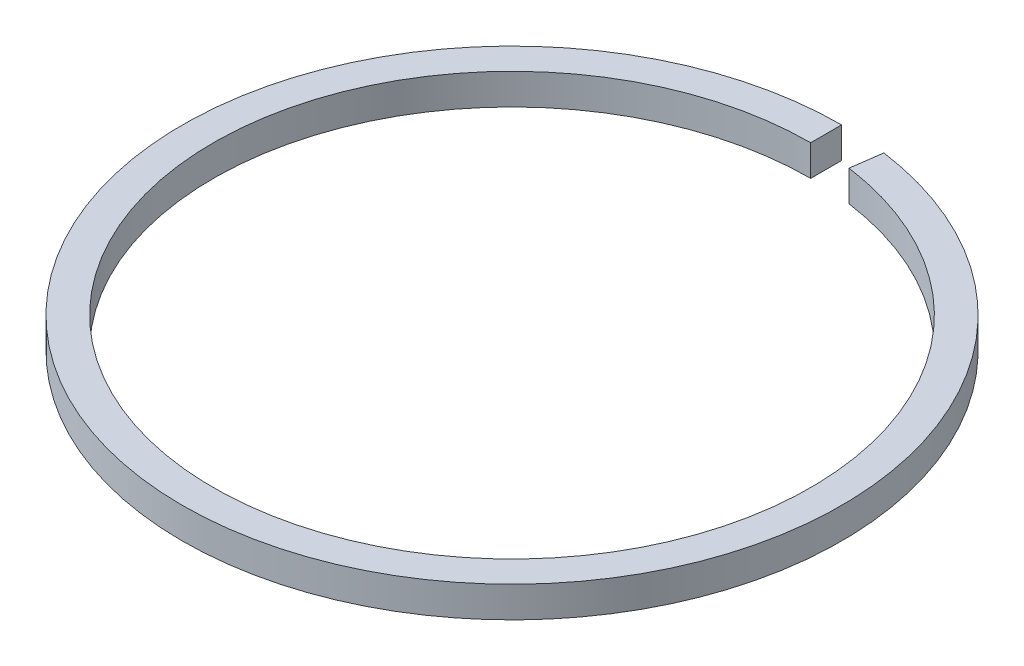
ISO-10303-21;
HEADER;
FILE_DESCRIPTION(('STEP AP214'),'2;1');
FILE_NAME('part.step','',(''),(''),'','','');
FILE_SCHEMA(('AUTOMOTIVE_DESIGN { 1 0 10303 214 1 1 1 1 }'));
ENDSEC;
DATA;
#1=APPLICATION_CONTEXT('core data for automotive mechanical design processes');
#2=APPLICATION_PROTOCOL_DEFINITION('international standard','automotive_design',2000,#1);
#3=PRODUCT_CONTEXT('',#1,'mechanical');
#4=PRODUCT('Part','Part','',(#3));
#5=PRODUCT_RELATED_PRODUCT_CATEGORY('part','',(#4));
#6=PRODUCT_DEFINITION_FORMATION('','',#4);
#7=PRODUCT_DEFINITION_CONTEXT('part definition',#1,'design');
#8=PRODUCT_DEFINITION('design','',#6,#7);
#9=PRODUCT_DEFINITION_SHAPE('','',#8);
#10=(LENGTH_UNIT() NAMED_UNIT(*) SI_UNIT(.MILLI.,.METRE.));
#11=(NAMED_UNIT(*) PLANE_ANGLE_UNIT() SI_UNIT($,.RADIAN.));
#12=(NAMED_UNIT(*) SI_UNIT($,.STERADIAN.) SOLID_ANGLE_UNIT());
#13=UNCERTAINTY_MEASURE_WITH_UNIT(LENGTH_MEASURE(1.E-05),#10,'distance_accuracy_value','');
#14=(GEOMETRIC_REPRESENTATION_CONTEXT(3) GLOBAL_UNCERTAINTY_ASSIGNED_CONTEXT((#13)) GLOBAL_UNIT_ASSIGNED_CONTEXT((#10,
#11,#12)) REPRESENTATION_CONTEXT('',''));
#15=CARTESIAN_POINT('',(0.,0.,0.));
#16=DIRECTION('',(0.,0.,1.));
#17=DIRECTION('',(1.,0.,0.));
#18=AXIS2_PLACEMENT_3D('',#15,#16,#17);
#19=CARTESIAN_POINT('',(0.,0.,0.));
#20=DIRECTION('',(-1.,0.,0.));
#21=DIRECTION('',(0.,0.,1.));
#22=AXIS2_PLACEMENT_3D('',#19,#20,#21);
#23=PLANE('',#22);
#24=DIRECTION('',(0.,1.,0.));
#25=VECTOR('',#24,1.);
#26=CARTESIAN_POINT('',(0.,-0.375,-0.375));
#27=LINE('',#26,#25);
#28=CARTESIAN_POINT('',(0.,-0.375,-0.375));
#29=VERTEX_POINT('',#28);
#30=CARTESIAN_POINT('',(0.,0.375,-0.375));
#31=VERTEX_POINT('',#30);
#32=EDGE_CURVE('E92',#29,#31,#27,.T.);
#33=ORIENTED_EDGE('',*,*,#32,.T.);
#34=DIRECTION('',(0.,0.,1.));
#35=VECTOR('',#34,1.);
#36=CARTESIAN_POINT('',(0.,0.375,0.375));
#37=LINE('',#36,#35);
#38=CARTESIAN_POINT('',(0.,0.375,0.375));
#39=VERTEX_POINT('',#38);
#40=EDGE_CURVE('E85',#31,#39,#37,.T.);
#41=ORIENTED_EDGE('',*,*,#40,.T.);
#42=DIRECTION('',(0.,-1.,0.));
#43=VECTOR('',#42,1.);
#44=CARTESIAN_POINT('',(0.,-0.375,0.375));
#45=LINE('',#44,#43);
#46=CARTESIAN_POINT('',(0.,-0.375,0.375));
#47=VERTEX_POINT('',#46);
#48=EDGE_CURVE('E80',#39,#47,#45,.T.);
#49=ORIENTED_EDGE('',*,*,#48,.T.);
#50=DIRECTION('',(0.,0.,-1.));
#51=VECTOR('',#50,1.);
#52=CARTESIAN_POINT('',(0.,-0.375,0.375));
#53=LINE('',#52,#51);
#54=EDGE_CURVE('E75',#47,#29,#53,.T.);
#55=ORIENTED_EDGE('',*,*,#54,.T.);
#56=EDGE_LOOP('',(#33,#41,#49,#55));
#57=FACE_BOUND('',#56,.T.);
#58=ADVANCED_FACE('F39',(#57),#23,.F.);
#59=CARTESIAN_POINT('',(1.05172413793104,0.,0.0728810034737131));
#60=DIRECTION('',(-0.990441835610005,0.,-0.137931034482759));
#61=DIRECTION('',(-0.137931034482759,0.,0.990441835610005));
#62=AXIS2_PLACEMENT_3D('',#59,#60,#61);
#63=PLANE('',#62);
#64=DIRECTION('',(0.,1.,0.));
#65=VECTOR('',#64,1.);
#66=CARTESIAN_POINT('',(1.10344827586208,-0.375,-0.298534684880039));
#67=LINE('',#66,#65);
#68=CARTESIAN_POINT('',(1.10344827586208,-0.375,-0.298534684880038));
#69=VERTEX_POINT('',#68);
#70=CARTESIAN_POINT('',(1.10344827586208,0.375,-0.298534684880038));
#71=VERTEX_POINT('',#70);
#72=EDGE_CURVE('E103',#69,#71,#67,.T.);
#73=ORIENTED_EDGE('',*,*,#72,.F.);
#74=DIRECTION('',(0.137931034482759,0.,-0.990441835610005));
#75=VECTOR('',#74,1.);
#76=CARTESIAN_POINT('',(1.00000000000001,-0.375,0.444296691827465));
#77=LINE('',#76,#75);
#78=CARTESIAN_POINT('',(1.00000000000001,-0.375,0.444296691827465));
#79=VERTEX_POINT('',#78);
#80=EDGE_CURVE('E11',#79,#69,#77,.T.);
#81=ORIENTED_EDGE('',*,*,#80,.F.);
#82=DIRECTION('',(0.,-1.,0.));
#83=VECTOR('',#82,1.);
#84=CARTESIAN_POINT('',(1.00000000000001,-0.375,0.444296691827465));
#85=LINE('',#84,#83);
#86=CARTESIAN_POINT('',(1.00000000000001,0.375,0.444296691827465));
#87=VERTEX_POINT('',#86);
#88=EDGE_CURVE('E54',#87,#79,#85,.T.);
#89=ORIENTED_EDGE('',*,*,#88,.F.);
#90=DIRECTION('',(-0.137931034482759,0.,0.990441835610005));
#91=VECTOR('',#90,1.);
#92=CARTESIAN_POINT('',(1.00000000000001,0.375,0.444296691827465));
#93=LINE('',#92,#91);
#94=EDGE_CURVE('E63',#71,#87,#93,.T.);
#95=ORIENTED_EDGE('',*,*,#94,.F.);
#96=EDGE_LOOP('',(#73,#81,#89,#95));
#97=FACE_BOUND('',#96,.T.);
#98=ADVANCED_FACE('F132',(#97),#63,.T.);
#99=CARTESIAN_POINT('',(0.,0.,7.625));
#100=DIRECTION('',(0.,1.,0.));
#101=DIRECTION('',(0.,0.,1.));
#102=AXIS2_PLACEMENT_3D('',#99,#100,#101);
#103=CYLINDRICAL_SURFACE('',#102,8.);
#104=CARTESIAN_POINT('',(0.,0.375,7.625));
#105=DIRECTION('',(0.,1.,0.));
#106=DIRECTION('',(0.,0.,-1.));
#107=AXIS2_PLACEMENT_3D('',#104,#105,#106);
#108=CIRCLE('',#107,8.);
#109=EDGE_CURVE('E95',#31,#71,#108,.T.);
#110=ORIENTED_EDGE('',*,*,#109,.F.);
#111=ORIENTED_EDGE('',*,*,#32,.F.);
#112=CARTESIAN_POINT('',(0.,-0.375,7.625));
#113=DIRECTION('',(0.,1.,0.));
#114=DIRECTION('',(0.,0.,-1.));
#115=AXIS2_PLACEMENT_3D('',#112,#113,#114);
#116=CIRCLE('',#115,8.);
#117=EDGE_CURVE('E94',#29,#69,#116,.T.);
#118=ORIENTED_EDGE('',*,*,#117,.T.);
#119=ORIENTED_EDGE('',*,*,#72,.T.);
#120=EDGE_LOOP('',(#110,#111,#118,#119));
#121=FACE_BOUND('',#120,.T.);
#122=ADVANCED_FACE('F93',(#121),#103,.T.);
#123=CARTESIAN_POINT('',(0.,0.375,0.375));
#124=DIRECTION('',(0.,-1.,0.));
#125=DIRECTION('',(0.,0.,-1.));
#126=AXIS2_PLACEMENT_3D('',#123,#124,#125);
#127=PLANE('',#126);
#128=CARTESIAN_POINT('',(0.,0.375,7.625));
#129=DIRECTION('',(0.,1.,0.));
#130=DIRECTION('',(0.,0.,-1.));
#131=AXIS2_PLACEMENT_3D('',#128,#129,#130);
#132=CIRCLE('',#131,7.25);
#133=EDGE_CURVE('E113',#39,#87,#132,.T.);
#134=ORIENTED_EDGE('',*,*,#133,.F.);
#135=ORIENTED_EDGE('',*,*,#40,.F.);
#136=ORIENTED_EDGE('',*,*,#109,.T.);
#137=ORIENTED_EDGE('',*,*,#94,.T.);
#138=EDGE_LOOP('',(#134,#135,#136,#137));
#139=FACE_BOUND('',#138,.T.);
#140=ADVANCED_FACE('F123',(#139),#127,.F.);
#141=CARTESIAN_POINT('',(0.,0.,7.625));
#142=DIRECTION('',(0.,1.,0.));
#143=DIRECTION('',(0.,0.,1.));
#144=AXIS2_PLACEMENT_3D('',#141,#142,#143);
#145=CYLINDRICAL_SURFACE('',#144,7.25);
#146=CARTESIAN_POINT('',(0.,-0.375,7.625));
#147=DIRECTION('',(0.,1.,0.));
#148=DIRECTION('',(0.,0.,-1.));
#149=AXIS2_PLACEMENT_3D('',#146,#147,#148);
#150=CIRCLE('',#149,7.25);
#151=EDGE_CURVE('E47',#47,#79,#150,.T.);
#152=ORIENTED_EDGE('',*,*,#151,.F.);
#153=ORIENTED_EDGE('',*,*,#48,.F.);
#154=ORIENTED_EDGE('',*,*,#133,.T.);
#155=ORIENTED_EDGE('',*,*,#88,.T.);
#156=EDGE_LOOP('',(#152,#153,#154,#155));
#157=FACE_BOUND('',#156,.T.);
#158=ADVANCED_FACE('F121',(#157),#145,.F.);
#159=CARTESIAN_POINT('',(0.,-0.375,0.375));
#160=DIRECTION('',(0.,1.,0.));
#161=DIRECTION('',(0.,0.,1.));
#162=AXIS2_PLACEMENT_3D('',#159,#160,#161);
#163=PLANE('',#162);
#164=ORIENTED_EDGE('',*,*,#80,.T.);
#165=ORIENTED_EDGE('',*,*,#117,.F.);
#166=ORIENTED_EDGE('',*,*,#54,.F.);
#167=ORIENTED_EDGE('',*,*,#151,.T.);
#168=EDGE_LOOP('',(#164,#165,#166,#167));
#169=FACE_BOUND('',#168,.T.);
#170=ADVANCED_FACE('F100',(#169),#163,.F.);
#171=CLOSED_SHELL('',(#58,#98,#122,#140,#158,#170));
#172=MANIFOLD_SOLID_BREP('B2',#171);
#173=ADVANCED_BREP_SHAPE_REPRESENTATION('',(#18,#172),#14);
#174=SHAPE_DEFINITION_REPRESENTATION(#9,#173);
ENDSEC;
END-ISO-10303-21;
